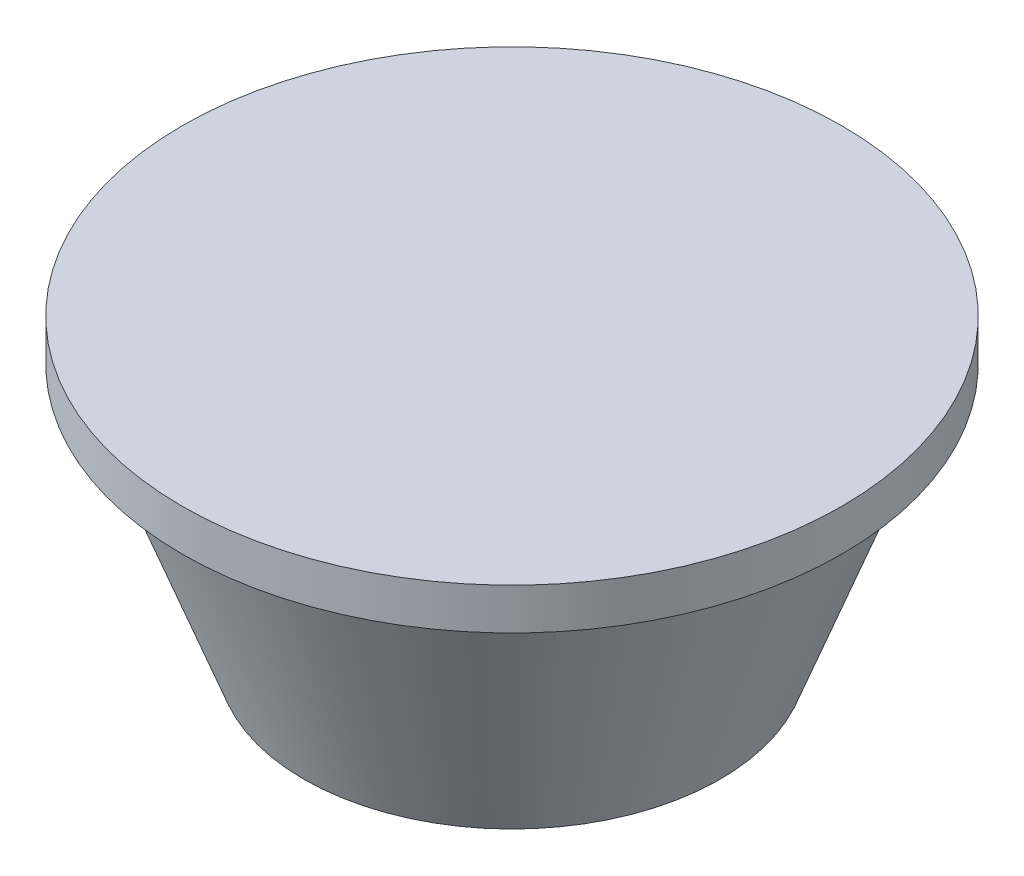
ISO-10303-21;
HEADER;
FILE_DESCRIPTION(('STEP AP214'),'2;1');
FILE_NAME('part.step','',(''),(''),'','','');
FILE_SCHEMA(('AUTOMOTIVE_DESIGN { 1 0 10303 214 1 1 1 1 }'));
ENDSEC;
DATA;
#1=APPLICATION_CONTEXT('core data for automotive mechanical design processes');
#2=APPLICATION_PROTOCOL_DEFINITION('international standard','automotive_design',2000,#1);
#3=PRODUCT_CONTEXT('',#1,'mechanical');
#4=PRODUCT('Part','Part','',(#3));
#5=PRODUCT_RELATED_PRODUCT_CATEGORY('part','',(#4));
#6=PRODUCT_DEFINITION_FORMATION('','',#4);
#7=PRODUCT_DEFINITION_CONTEXT('part definition',#1,'design');
#8=PRODUCT_DEFINITION('design','',#6,#7);
#9=PRODUCT_DEFINITION_SHAPE('','',#8);
#10=(LENGTH_UNIT() NAMED_UNIT(*) SI_UNIT(.MILLI.,.METRE.));
#11=(NAMED_UNIT(*) PLANE_ANGLE_UNIT() SI_UNIT($,.RADIAN.));
#12=(NAMED_UNIT(*) SI_UNIT($,.STERADIAN.) SOLID_ANGLE_UNIT());
#13=UNCERTAINTY_MEASURE_WITH_UNIT(LENGTH_MEASURE(1.E-05),#10,'distance_accuracy_value','');
#14=(GEOMETRIC_REPRESENTATION_CONTEXT(3) GLOBAL_UNCERTAINTY_ASSIGNED_CONTEXT((#13)) GLOBAL_UNIT_ASSIGNED_CONTEXT((#10,
#11,#12)) REPRESENTATION_CONTEXT('',''));
#15=CARTESIAN_POINT('',(0.,0.,0.));
#16=DIRECTION('',(0.,0.,1.));
#17=DIRECTION('',(1.,0.,0.));
#18=AXIS2_PLACEMENT_3D('',#15,#16,#17);
#19=CARTESIAN_POINT('',(0.,40.3,0.));
#20=DIRECTION('',(0.,-1.,0.));
#21=DIRECTION('',(0.,0.,-1.));
#22=AXIS2_PLACEMENT_3D('',#19,#20,#21);
#23=PLANE('',#22);
#24=CARTESIAN_POINT('',(0.,40.3,0.));
#25=DIRECTION('',(0.,-1.,0.));
#26=DIRECTION('',(0.,0.,-1.));
#27=AXIS2_PLACEMENT_3D('',#24,#25,#26);
#28=CIRCLE('',#27,45.6);
#29=CARTESIAN_POINT('',(0.,40.3,-45.6));
#30=VERTEX_POINT('',#29);
#31=EDGE_CURVE('E11',#30,#30,#28,.T.);
#32=ORIENTED_EDGE('',*,*,#31,.T.);
#33=EDGE_LOOP('',(#32));
#34=FACE_BOUND('',#33,.T.);
#35=ADVANCED_FACE('F45',(#34),#23,.T.);
#36=CARTESIAN_POINT('',(0.,40.3,0.));
#37=DIRECTION('',(0.,1.,0.));
#38=DIRECTION('',(0.,0.,1.));
#39=AXIS2_PLACEMENT_3D('',#36,#37,#38);
#40=CONICAL_SURFACE('',#39,45.6,0.358770670270572);
#41=CARTESIAN_POINT('',(0.,36.8333333333333,0.));
#42=DIRECTION('',(0.,-1.,0.));
#43=DIRECTION('',(0.,0.,-1.));
#44=AXIS2_PLACEMENT_3D('',#41,#42,#43);
#45=CIRCLE('',#44,44.3);
#46=CARTESIAN_POINT('',(0.,36.8333333333333,-44.3));
#47=VERTEX_POINT('',#46);
#48=EDGE_CURVE('E51',#47,#47,#45,.T.);
#49=ORIENTED_EDGE('',*,*,#48,.T.);
#50=EDGE_LOOP('',(#49));
#51=FACE_BOUND('',#50,.T.);
#52=ORIENTED_EDGE('',*,*,#31,.F.);
#53=EDGE_LOOP('',(#52));
#54=FACE_BOUND('',#53,.T.);
#55=ADVANCED_FACE('F77',(#51,#54),#40,.F.);
#56=CARTESIAN_POINT('',(0.,36.8333333333333,-44.3));
#57=DIRECTION('',(0.,-1.,0.));
#58=DIRECTION('',(0.,0.,-1.));
#59=AXIS2_PLACEMENT_3D('',#56,#57,#58);
#60=PLANE('',#59);
#61=CARTESIAN_POINT('',(0.,36.8333333333333,0.));
#62=DIRECTION('',(0.,-1.,0.));
#63=DIRECTION('',(0.,0.,-1.));
#64=AXIS2_PLACEMENT_3D('',#61,#62,#63);
#65=CIRCLE('',#64,47.5);
#66=CARTESIAN_POINT('',(0.,36.8333333333333,-47.5));
#67=VERTEX_POINT('',#66);
#68=EDGE_CURVE('E55',#67,#67,#65,.T.);
#69=ORIENTED_EDGE('',*,*,#68,.T.);
#70=EDGE_LOOP('',(#69));
#71=FACE_BOUND('',#70,.T.);
#72=ORIENTED_EDGE('',*,*,#48,.F.);
#73=EDGE_LOOP('',(#72));
#74=FACE_BOUND('',#73,.T.);
#75=ADVANCED_FACE('F74',(#71,#74),#60,.T.);
#76=CARTESIAN_POINT('',(0.,40.3,0.));
#77=DIRECTION('',(0.,-1.,0.));
#78=DIRECTION('',(0.,0.,-1.));
#79=AXIS2_PLACEMENT_3D('',#76,#77,#78);
#80=CYLINDRICAL_SURFACE('',#79,47.5);
#81=CARTESIAN_POINT('',(0.,42.8,0.));
#82=DIRECTION('',(0.,-1.,0.));
#83=DIRECTION('',(0.,0.,-1.));
#84=AXIS2_PLACEMENT_3D('',#81,#82,#83);
#85=CIRCLE('',#84,47.5);
#86=CARTESIAN_POINT('',(0.,42.8,-47.5));
#87=VERTEX_POINT('',#86);
#88=EDGE_CURVE('E59',#87,#87,#85,.T.);
#89=ORIENTED_EDGE('',*,*,#88,.T.);
#90=EDGE_LOOP('',(#89));
#91=FACE_BOUND('',#90,.T.);
#92=ORIENTED_EDGE('',*,*,#68,.F.);
#93=EDGE_LOOP('',(#92));
#94=FACE_BOUND('',#93,.T.);
#95=ADVANCED_FACE('F65',(#91,#94),#80,.T.);
#96=CARTESIAN_POINT('',(0.,42.8,-47.5));
#97=DIRECTION('',(0.,1.,0.));
#98=DIRECTION('',(0.,0.,1.));
#99=AXIS2_PLACEMENT_3D('',#96,#97,#98);
#100=PLANE('',#99);
#101=ORIENTED_EDGE('',*,*,#88,.F.);
#102=EDGE_LOOP('',(#101));
#103=FACE_BOUND('',#102,.T.);
#104=ADVANCED_FACE('F68',(#103),#100,.T.);
#105=CLOSED_SHELL('',(#35,#55,#75,#95,#104));
#106=MANIFOLD_SOLID_BREP('B2',#105);
#107=CARTESIAN_POINT('',(0.,0.,0.));
#108=DIRECTION('',(0.,1.,0.));
#109=DIRECTION('',(0.,0.,1.));
#110=AXIS2_PLACEMENT_3D('',#107,#108,#109);
#111=PLANE('',#110);
#112=CARTESIAN_POINT('',(0.,0.,0.));
#113=DIRECTION('',(0.,1.,0.));
#114=DIRECTION('',(0.,0.,1.));
#115=AXIS2_PLACEMENT_3D('',#112,#113,#114);
#116=CIRCLE('',#115,30.);
#117=CARTESIAN_POINT('',(0.,1.104157637474E-13,30.));
#118=VERTEX_POINT('',#117);
#119=EDGE_CURVE('E133',#118,#118,#116,.T.);
#120=ORIENTED_EDGE('',*,*,#119,.F.);
#121=EDGE_LOOP('',(#120));
#122=FACE_BOUND('',#121,.T.);
#123=ADVANCED_FACE('F116',(#122),#111,.F.);
#124=CARTESIAN_POINT('',(0.,1.99999999999998,-28.6139990636706));
#125=DIRECTION('',(0.,-1.,0.));
#126=DIRECTION('',(0.,0.,-1.));
#127=AXIS2_PLACEMENT_3D('',#124,#125,#126);
#128=PLANE('',#127);
#129=CARTESIAN_POINT('',(0.,2.00000000000006,0.));
#130=DIRECTION('',(0.,1.,0.));
#131=DIRECTION('',(0.,0.,1.));
#132=AXIS2_PLACEMENT_3D('',#129,#130,#131);
#133=CIRCLE('',#132,28.6139990636706);
#134=CARTESIAN_POINT('',(0.,2.00000000000011,28.6139990636706));
#135=VERTEX_POINT('',#134);
#136=EDGE_CURVE('E44',#135,#135,#133,.T.);
#137=ORIENTED_EDGE('',*,*,#136,.T.);
#138=EDGE_LOOP('',(#137));
#139=FACE_BOUND('',#138,.T.);
#140=ADVANCED_FACE('F143',(#139),#128,.F.);
#141=CARTESIAN_POINT('',(0.,40.0000000000001,0.));
#142=DIRECTION('',(0.,1.,0.));
#143=DIRECTION('',(0.,0.,1.));
#144=AXIS2_PLACEMENT_3D('',#141,#142,#143);
#145=CONICAL_SURFACE('',#144,42.8639990636705,0.35877067027057);
#146=ORIENTED_EDGE('',*,*,#136,.F.);
#147=EDGE_LOOP('',(#146));
#148=FACE_BOUND('',#147,.T.);
#149=CARTESIAN_POINT('',(0.,40.0000000000001,0.));
#150=DIRECTION('',(0.,1.,0.));
#151=DIRECTION('',(0.,0.,1.));
#152=AXIS2_PLACEMENT_3D('',#149,#150,#151);
#153=CIRCLE('',#152,42.8639990636706);
#154=CARTESIAN_POINT('',(0.,40.0000000000002,42.8639990636705));
#155=VERTEX_POINT('',#154);
#156=EDGE_CURVE('E123',#155,#155,#153,.T.);
#157=ORIENTED_EDGE('',*,*,#156,.T.);
#158=EDGE_LOOP('',(#157));
#159=FACE_BOUND('',#158,.T.);
#160=ADVANCED_FACE('F147',(#148,#159),#145,.F.);
#161=CARTESIAN_POINT('',(0.,40.,-45.));
#162=DIRECTION('',(0.,-1.,0.));
#163=DIRECTION('',(0.,0.,-1.));
#164=AXIS2_PLACEMENT_3D('',#161,#162,#163);
#165=PLANE('',#164);
#166=ORIENTED_EDGE('',*,*,#156,.F.);
#167=EDGE_LOOP('',(#166));
#168=FACE_BOUND('',#167,.T.);
#169=CARTESIAN_POINT('',(0.,40.0000000000001,0.));
#170=DIRECTION('',(0.,1.,0.));
#171=DIRECTION('',(0.,0.,1.));
#172=AXIS2_PLACEMENT_3D('',#169,#170,#171);
#173=CIRCLE('',#172,44.9999999999999);
#174=CARTESIAN_POINT('',(0.,40.0000000000002,44.9999999999999));
#175=VERTEX_POINT('',#174);
#176=EDGE_CURVE('E128',#175,#175,#173,.T.);
#177=ORIENTED_EDGE('',*,*,#176,.T.);
#178=EDGE_LOOP('',(#177));
#179=FACE_BOUND('',#178,.T.);
#180=ADVANCED_FACE('F151',(#168,#179),#165,.F.);
#181=CARTESIAN_POINT('',(0.,0.,0.));
#182=DIRECTION('',(0.,1.,0.));
#183=DIRECTION('',(0.,0.,1.));
#184=AXIS2_PLACEMENT_3D('',#181,#182,#183);
#185=CONICAL_SURFACE('',#184,30.,0.358770670270571);
#186=ORIENTED_EDGE('',*,*,#176,.F.);
#187=EDGE_LOOP('',(#186));
#188=FACE_BOUND('',#187,.T.);
#189=ORIENTED_EDGE('',*,*,#119,.T.);
#190=EDGE_LOOP('',(#189));
#191=FACE_BOUND('',#190,.T.);
#192=ADVANCED_FACE('F140',(#188,#191),#185,.T.);
#193=CLOSED_SHELL('',(#123,#140,#160,#180,#192));
#194=MANIFOLD_SOLID_BREP('B6',#193);
#195=ADVANCED_BREP_SHAPE_REPRESENTATION('',(#18,#106,#194),#14);
#196=SHAPE_DEFINITION_REPRESENTATION(#9,#195);
ENDSEC;
END-ISO-10303-21;
